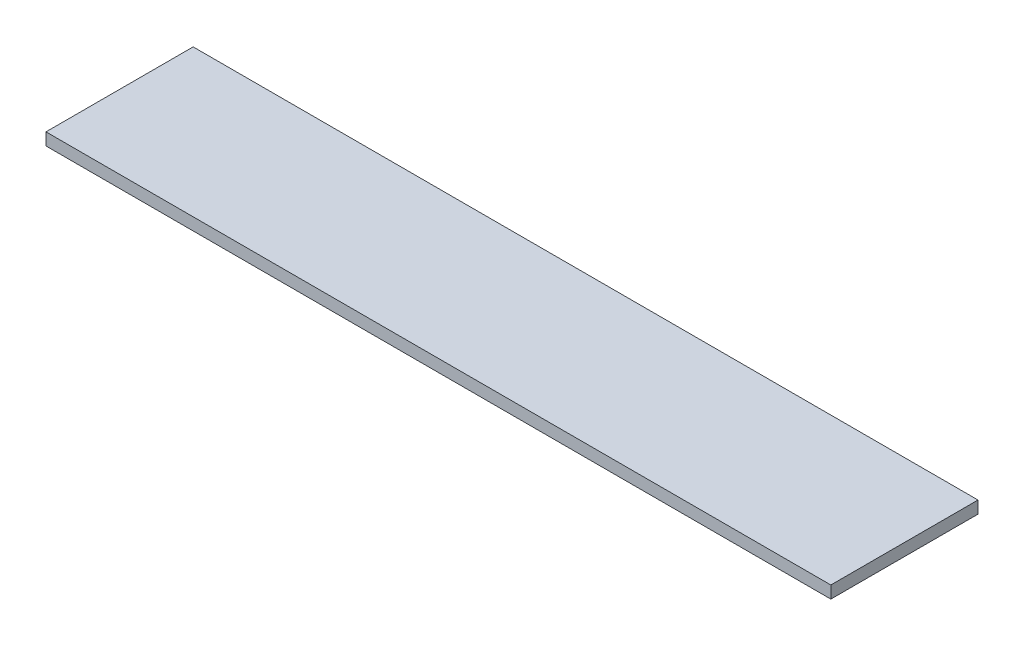
ISO-10303-21;
HEADER;
FILE_DESCRIPTION(('STEP AP214'),'2;1');
FILE_NAME('part.step','',(''),(''),'','','');
FILE_SCHEMA(('AUTOMOTIVE_DESIGN { 1 0 10303 214 1 1 1 1 }'));
ENDSEC;
DATA;
#1=APPLICATION_CONTEXT('core data for automotive mechanical design processes');
#2=APPLICATION_PROTOCOL_DEFINITION('international standard','automotive_design',2000,#1);
#3=PRODUCT_CONTEXT('',#1,'mechanical');
#4=PRODUCT('Part','Part','',(#3));
#5=PRODUCT_RELATED_PRODUCT_CATEGORY('part','',(#4));
#6=PRODUCT_DEFINITION_FORMATION('','',#4);
#7=PRODUCT_DEFINITION_CONTEXT('part definition',#1,'design');
#8=PRODUCT_DEFINITION('design','',#6,#7);
#9=PRODUCT_DEFINITION_SHAPE('','',#8);
#10=(LENGTH_UNIT() NAMED_UNIT(*) SI_UNIT(.MILLI.,.METRE.));
#11=(NAMED_UNIT(*) PLANE_ANGLE_UNIT() SI_UNIT($,.RADIAN.));
#12=(NAMED_UNIT(*) SI_UNIT($,.STERADIAN.) SOLID_ANGLE_UNIT());
#13=UNCERTAINTY_MEASURE_WITH_UNIT(LENGTH_MEASURE(1.E-05),#10,'distance_accuracy_value','');
#14=(GEOMETRIC_REPRESENTATION_CONTEXT(3) GLOBAL_UNCERTAINTY_ASSIGNED_CONTEXT((#13)) GLOBAL_UNIT_ASSIGNED_CONTEXT((#10,
#11,#12)) REPRESENTATION_CONTEXT('',''));
#15=CARTESIAN_POINT('',(0.,0.,0.));
#16=DIRECTION('',(0.,0.,1.));
#17=DIRECTION('',(1.,0.,0.));
#18=AXIS2_PLACEMENT_3D('',#15,#16,#17);
#19=CARTESIAN_POINT('',(0.,6.35,0.));
#20=DIRECTION('',(0.,1.,0.));
#21=DIRECTION('',(0.,0.,1.));
#22=AXIS2_PLACEMENT_3D('',#19,#20,#21);
#23=PLANE('',#22);
#24=DIRECTION('',(0.,0.,1.));
#25=VECTOR('',#24,1.);
#26=CARTESIAN_POINT('',(0.,6.35,-76.2));
#27=LINE('',#26,#25);
#28=CARTESIAN_POINT('',(0.,6.35,0.));
#29=VERTEX_POINT('',#28);
#30=CARTESIAN_POINT('',(0.,6.35,-76.2));
#31=VERTEX_POINT('',#30);
#32=EDGE_CURVE('E67',#29,#31,#27,.F.);
#33=ORIENTED_EDGE('',*,*,#32,.F.);
#34=DIRECTION('',(1.,0.,0.));
#35=VECTOR('',#34,1.);
#36=CARTESIAN_POINT('',(0.,6.35,0.));
#37=LINE('',#36,#35);
#38=CARTESIAN_POINT('',(406.4,6.35,0.));
#39=VERTEX_POINT('',#38);
#40=EDGE_CURVE('E19',#39,#29,#37,.F.);
#41=ORIENTED_EDGE('',*,*,#40,.F.);
#42=DIRECTION('',(0.,0.,-1.));
#43=VECTOR('',#42,1.);
#44=CARTESIAN_POINT('',(406.4,6.35,0.));
#45=LINE('',#44,#43);
#46=CARTESIAN_POINT('',(406.4,6.35,-76.2));
#47=VERTEX_POINT('',#46);
#48=EDGE_CURVE('E57',#47,#39,#45,.F.);
#49=ORIENTED_EDGE('',*,*,#48,.F.);
#50=DIRECTION('',(-1.,0.,0.));
#51=VECTOR('',#50,1.);
#52=CARTESIAN_POINT('',(406.4,6.35,-76.2));
#53=LINE('',#52,#51);
#54=EDGE_CURVE('E52',#31,#47,#53,.F.);
#55=ORIENTED_EDGE('',*,*,#54,.F.);
#56=EDGE_LOOP('',(#33,#41,#49,#55));
#57=FACE_BOUND('',#56,.T.);
#58=ADVANCED_FACE('F16',(#57),#23,.T.);
#59=CARTESIAN_POINT('',(0.,0.,0.));
#60=DIRECTION('',(0.,0.,1.));
#61=DIRECTION('',(1.,0.,0.));
#62=AXIS2_PLACEMENT_3D('',#59,#60,#61);
#63=PLANE('',#62);
#64=DIRECTION('',(0.,1.,0.));
#65=VECTOR('',#64,1.);
#66=CARTESIAN_POINT('',(0.,0.,0.));
#67=LINE('',#66,#65);
#68=CARTESIAN_POINT('',(0.,0.,0.));
#69=VERTEX_POINT('',#68);
#70=EDGE_CURVE('E78',#69,#29,#67,.T.);
#71=ORIENTED_EDGE('',*,*,#70,.F.);
#72=DIRECTION('',(1.,0.,0.));
#73=VECTOR('',#72,1.);
#74=CARTESIAN_POINT('',(0.,0.,0.));
#75=LINE('',#74,#73);
#76=CARTESIAN_POINT('',(406.4,0.,0.));
#77=VERTEX_POINT('',#76);
#78=EDGE_CURVE('E73',#69,#77,#75,.T.);
#79=ORIENTED_EDGE('',*,*,#78,.T.);
#80=DIRECTION('',(0.,1.,0.));
#81=VECTOR('',#80,1.);
#82=CARTESIAN_POINT('',(406.4,0.,0.));
#83=LINE('',#82,#81);
#84=EDGE_CURVE('E62',#39,#77,#83,.F.);
#85=ORIENTED_EDGE('',*,*,#84,.F.);
#86=ORIENTED_EDGE('',*,*,#40,.T.);
#87=EDGE_LOOP('',(#71,#79,#85,#86));
#88=FACE_BOUND('',#87,.T.);
#89=ADVANCED_FACE('F72',(#88),#63,.T.);
#90=CARTESIAN_POINT('',(406.4,0.,0.));
#91=DIRECTION('',(1.,0.,0.));
#92=DIRECTION('',(0.,0.,-1.));
#93=AXIS2_PLACEMENT_3D('',#90,#91,#92);
#94=PLANE('',#93);
#95=ORIENTED_EDGE('',*,*,#84,.T.);
#96=DIRECTION('',(0.,0.,1.));
#97=VECTOR('',#96,1.);
#98=CARTESIAN_POINT('',(406.4,0.,0.));
#99=LINE('',#98,#97);
#100=CARTESIAN_POINT('',(406.4,0.,-76.2));
#101=VERTEX_POINT('',#100);
#102=EDGE_CURVE('E83',#77,#101,#99,.F.);
#103=ORIENTED_EDGE('',*,*,#102,.T.);
#104=DIRECTION('',(0.,1.,0.));
#105=VECTOR('',#104,1.);
#106=CARTESIAN_POINT('',(406.4,0.,-76.2));
#107=LINE('',#106,#105);
#108=EDGE_CURVE('E64',#47,#101,#107,.F.);
#109=ORIENTED_EDGE('',*,*,#108,.F.);
#110=ORIENTED_EDGE('',*,*,#48,.T.);
#111=EDGE_LOOP('',(#95,#103,#109,#110));
#112=FACE_BOUND('',#111,.T.);
#113=ADVANCED_FACE('F59',(#112),#94,.T.);
#114=CARTESIAN_POINT('',(406.4,0.,-76.2));
#115=DIRECTION('',(0.,0.,-1.));
#116=DIRECTION('',(-1.,0.,0.));
#117=AXIS2_PLACEMENT_3D('',#114,#115,#116);
#118=PLANE('',#117);
#119=ORIENTED_EDGE('',*,*,#108,.T.);
#120=DIRECTION('',(1.,0.,0.));
#121=VECTOR('',#120,1.);
#122=CARTESIAN_POINT('',(0.,0.,-76.2));
#123=LINE('',#122,#121);
#124=CARTESIAN_POINT('',(0.,0.,-76.2));
#125=VERTEX_POINT('',#124);
#126=EDGE_CURVE('E25',#101,#125,#123,.F.);
#127=ORIENTED_EDGE('',*,*,#126,.T.);
#128=DIRECTION('',(0.,1.,0.));
#129=VECTOR('',#128,1.);
#130=CARTESIAN_POINT('',(0.,0.,-76.2));
#131=LINE('',#130,#129);
#132=EDGE_CURVE('E33',#31,#125,#131,.F.);
#133=ORIENTED_EDGE('',*,*,#132,.F.);
#134=ORIENTED_EDGE('',*,*,#54,.T.);
#135=EDGE_LOOP('',(#119,#127,#133,#134));
#136=FACE_BOUND('',#135,.T.);
#137=ADVANCED_FACE('F87',(#136),#118,.T.);
#138=CARTESIAN_POINT('',(0.,0.,-76.2));
#139=DIRECTION('',(-1.,0.,0.));
#140=DIRECTION('',(0.,0.,1.));
#141=AXIS2_PLACEMENT_3D('',#138,#139,#140);
#142=PLANE('',#141);
#143=ORIENTED_EDGE('',*,*,#132,.T.);
#144=DIRECTION('',(0.,0.,1.));
#145=VECTOR('',#144,1.);
#146=CARTESIAN_POINT('',(0.,0.,0.));
#147=LINE('',#146,#145);
#148=EDGE_CURVE('E11',#125,#69,#147,.T.);
#149=ORIENTED_EDGE('',*,*,#148,.T.);
#150=ORIENTED_EDGE('',*,*,#70,.T.);
#151=ORIENTED_EDGE('',*,*,#32,.T.);
#152=EDGE_LOOP('',(#143,#149,#150,#151));
#153=FACE_BOUND('',#152,.T.);
#154=ADVANCED_FACE('F90',(#153),#142,.T.);
#155=CARTESIAN_POINT('',(0.,0.,0.));
#156=DIRECTION('',(0.,1.,0.));
#157=DIRECTION('',(0.,0.,1.));
#158=AXIS2_PLACEMENT_3D('',#155,#156,#157);
#159=PLANE('',#158);
#160=ORIENTED_EDGE('',*,*,#126,.F.);
#161=ORIENTED_EDGE('',*,*,#102,.F.);
#162=ORIENTED_EDGE('',*,*,#78,.F.);
#163=ORIENTED_EDGE('',*,*,#148,.F.);
#164=EDGE_LOOP('',(#160,#161,#162,#163));
#165=FACE_BOUND('',#164,.T.);
#166=ADVANCED_FACE('F89',(#165),#159,.F.);
#167=CLOSED_SHELL('',(#58,#89,#113,#137,#154,#166));
#168=MANIFOLD_SOLID_BREP('B1',#167);
#169=ADVANCED_BREP_SHAPE_REPRESENTATION('',(#18,#168),#14);
#170=SHAPE_DEFINITION_REPRESENTATION(#9,#169);
ENDSEC;
END-ISO-10303-21;
